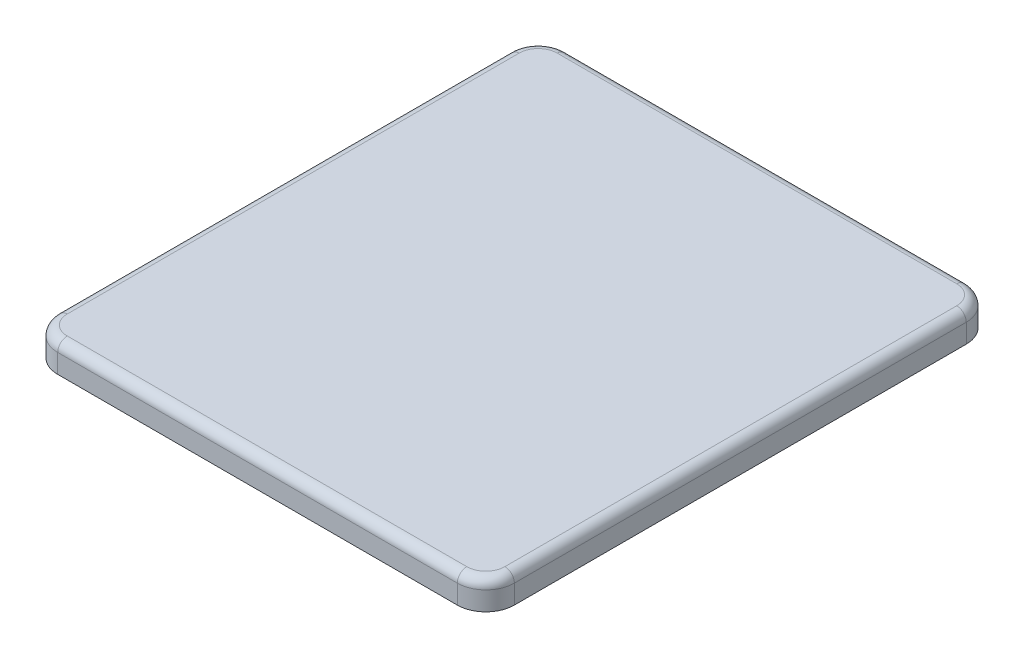
ISO-10303-21;
HEADER;
FILE_DESCRIPTION(('STEP AP214'),'2;1');
FILE_NAME('part.step','',(''),(''),'','','');
FILE_SCHEMA(('AUTOMOTIVE_DESIGN { 1 0 10303 214 1 1 1 1 }'));
ENDSEC;
DATA;
#1=APPLICATION_CONTEXT('core data for automotive mechanical design processes');
#2=APPLICATION_PROTOCOL_DEFINITION('international standard','automotive_design',2000,#1);
#3=PRODUCT_CONTEXT('',#1,'mechanical');
#4=PRODUCT('Part','Part','',(#3));
#5=PRODUCT_RELATED_PRODUCT_CATEGORY('part','',(#4));
#6=PRODUCT_DEFINITION_FORMATION('','',#4);
#7=PRODUCT_DEFINITION_CONTEXT('part definition',#1,'design');
#8=PRODUCT_DEFINITION('design','',#6,#7);
#9=PRODUCT_DEFINITION_SHAPE('','',#8);
#10=(LENGTH_UNIT() NAMED_UNIT(*) SI_UNIT(.MILLI.,.METRE.));
#11=(NAMED_UNIT(*) PLANE_ANGLE_UNIT() SI_UNIT($,.RADIAN.));
#12=(NAMED_UNIT(*) SI_UNIT($,.STERADIAN.) SOLID_ANGLE_UNIT());
#13=UNCERTAINTY_MEASURE_WITH_UNIT(LENGTH_MEASURE(1.E-05),#10,'distance_accuracy_value','');
#14=(GEOMETRIC_REPRESENTATION_CONTEXT(3) GLOBAL_UNCERTAINTY_ASSIGNED_CONTEXT((#13)) GLOBAL_UNIT_ASSIGNED_CONTEXT((#10,
#11,#12)) REPRESENTATION_CONTEXT('',''));
#15=CARTESIAN_POINT('',(0.,0.,0.));
#16=DIRECTION('',(0.,0.,1.));
#17=DIRECTION('',(1.,0.,0.));
#18=AXIS2_PLACEMENT_3D('',#15,#16,#17);
#19=CARTESIAN_POINT('',(24.,3.,26.75));
#20=DIRECTION('',(-1.,0.,0.));
#21=DIRECTION('',(0.,0.,1.));
#22=AXIS2_PLACEMENT_3D('',#19,#20,#21);
#23=PLANE('',#22);
#24=DIRECTION('',(0.,-1.,0.));
#25=VECTOR('',#24,1.);
#26=CARTESIAN_POINT('',(24.,3.,-23.75));
#27=LINE('',#26,#25);
#28=CARTESIAN_POINT('',(24.,0.,-23.75));
#29=VERTEX_POINT('',#28);
#30=CARTESIAN_POINT('',(24.,2.,-23.75));
#31=VERTEX_POINT('',#30);
#32=EDGE_CURVE('E171',#29,#31,#27,.F.);
#33=ORIENTED_EDGE('',*,*,#32,.T.);
#34=DIRECTION('',(0.,0.,-1.));
#35=VECTOR('',#34,1.);
#36=CARTESIAN_POINT('',(24.,2.,26.75));
#37=LINE('',#36,#35);
#38=CARTESIAN_POINT('',(24.,2.,23.75));
#39=VERTEX_POINT('',#38);
#40=EDGE_CURVE('E200',#31,#39,#37,.F.);
#41=ORIENTED_EDGE('',*,*,#40,.T.);
#42=DIRECTION('',(0.,-1.,0.));
#43=VECTOR('',#42,1.);
#44=CARTESIAN_POINT('',(24.,3.,23.75));
#45=LINE('',#44,#43);
#46=CARTESIAN_POINT('',(24.,0.,23.75));
#47=VERTEX_POINT('',#46);
#48=EDGE_CURVE('E169',#39,#47,#45,.T.);
#49=ORIENTED_EDGE('',*,*,#48,.T.);
#50=DIRECTION('',(0.,0.,-1.));
#51=VECTOR('',#50,1.);
#52=CARTESIAN_POINT('',(24.,0.,26.75));
#53=LINE('',#52,#51);
#54=EDGE_CURVE('E225',#47,#29,#53,.T.);
#55=ORIENTED_EDGE('',*,*,#54,.T.);
#56=EDGE_LOOP('',(#33,#41,#49,#55));
#57=FACE_BOUND('',#56,.T.);
#58=ADVANCED_FACE('F38',(#57),#23,.F.);
#59=CARTESIAN_POINT('',(-24.,3.,-26.75));
#60=DIRECTION('',(0.,0.,1.));
#61=DIRECTION('',(1.,0.,0.));
#62=AXIS2_PLACEMENT_3D('',#59,#60,#61);
#63=PLANE('',#62);
#64=DIRECTION('',(0.,-1.,0.));
#65=VECTOR('',#64,1.);
#66=CARTESIAN_POINT('',(-21.,3.,-26.75));
#67=LINE('',#66,#65);
#68=CARTESIAN_POINT('',(-21.,0.,-26.75));
#69=VERTEX_POINT('',#68);
#70=CARTESIAN_POINT('',(-21.,2.,-26.75));
#71=VERTEX_POINT('',#70);
#72=EDGE_CURVE('E166',#69,#71,#67,.F.);
#73=ORIENTED_EDGE('',*,*,#72,.T.);
#74=DIRECTION('',(-1.,0.,0.));
#75=VECTOR('',#74,1.);
#76=CARTESIAN_POINT('',(-24.,2.,-26.75));
#77=LINE('',#76,#75);
#78=CARTESIAN_POINT('',(21.,2.,-26.75));
#79=VERTEX_POINT('',#78);
#80=EDGE_CURVE('E196',#71,#79,#77,.F.);
#81=ORIENTED_EDGE('',*,*,#80,.T.);
#82=DIRECTION('',(0.,-1.,0.));
#83=VECTOR('',#82,1.);
#84=CARTESIAN_POINT('',(21.,3.,-26.75));
#85=LINE('',#84,#83);
#86=CARTESIAN_POINT('',(21.,0.,-26.75));
#87=VERTEX_POINT('',#86);
#88=EDGE_CURVE('E164',#79,#87,#85,.T.);
#89=ORIENTED_EDGE('',*,*,#88,.T.);
#90=DIRECTION('',(-1.,0.,0.));
#91=VECTOR('',#90,1.);
#92=CARTESIAN_POINT('',(-24.,0.,-26.75));
#93=LINE('',#92,#91);
#94=EDGE_CURVE('E154',#87,#69,#93,.T.);
#95=ORIENTED_EDGE('',*,*,#94,.T.);
#96=EDGE_LOOP('',(#73,#81,#89,#95));
#97=FACE_BOUND('',#96,.T.);
#98=ADVANCED_FACE('F238',(#97),#63,.F.);
#99=CARTESIAN_POINT('',(-24.,3.,26.75));
#100=DIRECTION('',(1.,0.,0.));
#101=DIRECTION('',(0.,0.,-1.));
#102=AXIS2_PLACEMENT_3D('',#99,#100,#101);
#103=PLANE('',#102);
#104=DIRECTION('',(0.,-1.,0.));
#105=VECTOR('',#104,1.);
#106=CARTESIAN_POINT('',(-24.,3.,23.75));
#107=LINE('',#106,#105);
#108=CARTESIAN_POINT('',(-24.,0.,23.75));
#109=VERTEX_POINT('',#108);
#110=CARTESIAN_POINT('',(-24.,2.,23.75));
#111=VERTEX_POINT('',#110);
#112=EDGE_CURVE('E141',#109,#111,#107,.F.);
#113=ORIENTED_EDGE('',*,*,#112,.T.);
#114=DIRECTION('',(0.,0.,1.));
#115=VECTOR('',#114,1.);
#116=CARTESIAN_POINT('',(-24.,2.,26.75));
#117=LINE('',#116,#115);
#118=CARTESIAN_POINT('',(-24.,2.,-23.75));
#119=VERTEX_POINT('',#118);
#120=EDGE_CURVE('E191',#111,#119,#117,.F.);
#121=ORIENTED_EDGE('',*,*,#120,.T.);
#122=DIRECTION('',(0.,-1.,0.));
#123=VECTOR('',#122,1.);
#124=CARTESIAN_POINT('',(-24.,3.,-23.75));
#125=LINE('',#124,#123);
#126=CARTESIAN_POINT('',(-24.,0.,-23.75));
#127=VERTEX_POINT('',#126);
#128=EDGE_CURVE('E145',#119,#127,#125,.T.);
#129=ORIENTED_EDGE('',*,*,#128,.T.);
#130=DIRECTION('',(0.,0.,1.));
#131=VECTOR('',#130,1.);
#132=CARTESIAN_POINT('',(-24.,0.,26.75));
#133=LINE('',#132,#131);
#134=EDGE_CURVE('E151',#127,#109,#133,.T.);
#135=ORIENTED_EDGE('',*,*,#134,.T.);
#136=EDGE_LOOP('',(#113,#121,#129,#135));
#137=FACE_BOUND('',#136,.T.);
#138=ADVANCED_FACE('F255',(#137),#103,.F.);
#139=CARTESIAN_POINT('',(-24.,3.,26.75));
#140=DIRECTION('',(0.,0.,-1.));
#141=DIRECTION('',(-1.,0.,0.));
#142=AXIS2_PLACEMENT_3D('',#139,#140,#141);
#143=PLANE('',#142);
#144=DIRECTION('',(0.,-1.,0.));
#145=VECTOR('',#144,1.);
#146=CARTESIAN_POINT('',(21.,3.,26.75));
#147=LINE('',#146,#145);
#148=CARTESIAN_POINT('',(21.,0.,26.75));
#149=VERTEX_POINT('',#148);
#150=CARTESIAN_POINT('',(21.,2.,26.75));
#151=VERTEX_POINT('',#150);
#152=EDGE_CURVE('E135',#149,#151,#147,.F.);
#153=ORIENTED_EDGE('',*,*,#152,.T.);
#154=DIRECTION('',(1.,0.,0.));
#155=VECTOR('',#154,1.);
#156=CARTESIAN_POINT('',(-24.,2.,26.75));
#157=LINE('',#156,#155);
#158=CARTESIAN_POINT('',(-21.,2.,26.75));
#159=VERTEX_POINT('',#158);
#160=EDGE_CURVE('E47',#151,#159,#157,.F.);
#161=ORIENTED_EDGE('',*,*,#160,.T.);
#162=DIRECTION('',(0.,-1.,0.));
#163=VECTOR('',#162,1.);
#164=CARTESIAN_POINT('',(-21.,3.,26.75));
#165=LINE('',#164,#163);
#166=CARTESIAN_POINT('',(-21.,0.,26.75));
#167=VERTEX_POINT('',#166);
#168=EDGE_CURVE('E127',#159,#167,#165,.T.);
#169=ORIENTED_EDGE('',*,*,#168,.T.);
#170=DIRECTION('',(1.,0.,0.));
#171=VECTOR('',#170,1.);
#172=CARTESIAN_POINT('',(-24.,0.,26.75));
#173=LINE('',#172,#171);
#174=EDGE_CURVE('E131',#167,#149,#173,.T.);
#175=ORIENTED_EDGE('',*,*,#174,.T.);
#176=EDGE_LOOP('',(#153,#161,#169,#175));
#177=FACE_BOUND('',#176,.T.);
#178=ADVANCED_FACE('F129',(#177),#143,.F.);
#179=CARTESIAN_POINT('',(0.,3.,0.));
#180=DIRECTION('',(0.,-1.,0.));
#181=DIRECTION('',(0.,0.,-1.));
#182=AXIS2_PLACEMENT_3D('',#179,#180,#181);
#183=PLANE('',#182);
#184=CARTESIAN_POINT('',(-21.,3.,-23.75));
#185=DIRECTION('',(0.,-1.,0.));
#186=DIRECTION('',(0.,0.,-1.));
#187=AXIS2_PLACEMENT_3D('',#184,#185,#186);
#188=CIRCLE('',#187,2.);
#189=CARTESIAN_POINT('',(-21.,3.,-25.75));
#190=VERTEX_POINT('',#189);
#191=CARTESIAN_POINT('',(-23.,3.,-23.75));
#192=VERTEX_POINT('',#191);
#193=EDGE_CURVE('E186',#190,#192,#188,.F.);
#194=ORIENTED_EDGE('',*,*,#193,.T.);
#195=DIRECTION('',(0.,0.,1.));
#196=VECTOR('',#195,1.);
#197=CARTESIAN_POINT('',(-23.,3.,0.));
#198=LINE('',#197,#196);
#199=CARTESIAN_POINT('',(-23.,3.,23.75));
#200=VERTEX_POINT('',#199);
#201=EDGE_CURVE('E188',#192,#200,#198,.T.);
#202=ORIENTED_EDGE('',*,*,#201,.T.);
#203=CARTESIAN_POINT('',(-21.,3.,23.75));
#204=DIRECTION('',(0.,-1.,0.));
#205=DIRECTION('',(0.,0.,-1.));
#206=AXIS2_PLACEMENT_3D('',#203,#204,#205);
#207=CIRCLE('',#206,2.);
#208=CARTESIAN_POINT('',(-21.,3.,25.75));
#209=VERTEX_POINT('',#208);
#210=EDGE_CURVE('E174',#200,#209,#207,.F.);
#211=ORIENTED_EDGE('',*,*,#210,.T.);
#212=DIRECTION('',(1.,0.,0.));
#213=VECTOR('',#212,1.);
#214=CARTESIAN_POINT('',(0.,3.,25.75));
#215=LINE('',#214,#213);
#216=CARTESIAN_POINT('',(21.,3.,25.75));
#217=VERTEX_POINT('',#216);
#218=EDGE_CURVE('E176',#209,#217,#215,.T.);
#219=ORIENTED_EDGE('',*,*,#218,.T.);
#220=CARTESIAN_POINT('',(21.,3.,23.75));
#221=DIRECTION('',(0.,-1.,0.));
#222=DIRECTION('',(0.,0.,-1.));
#223=AXIS2_PLACEMENT_3D('',#220,#221,#222);
#224=CIRCLE('',#223,2.);
#225=CARTESIAN_POINT('',(23.,3.,23.75));
#226=VERTEX_POINT('',#225);
#227=EDGE_CURVE('E178',#217,#226,#224,.F.);
#228=ORIENTED_EDGE('',*,*,#227,.T.);
#229=DIRECTION('',(0.,0.,-1.));
#230=VECTOR('',#229,1.);
#231=CARTESIAN_POINT('',(23.,3.,0.));
#232=LINE('',#231,#230);
#233=CARTESIAN_POINT('',(23.,3.,-23.75));
#234=VERTEX_POINT('',#233);
#235=EDGE_CURVE('E180',#226,#234,#232,.T.);
#236=ORIENTED_EDGE('',*,*,#235,.T.);
#237=CARTESIAN_POINT('',(21.,3.,-23.75));
#238=DIRECTION('',(0.,-1.,0.));
#239=DIRECTION('',(0.,0.,-1.));
#240=AXIS2_PLACEMENT_3D('',#237,#238,#239);
#241=CIRCLE('',#240,2.);
#242=CARTESIAN_POINT('',(21.,3.,-25.75));
#243=VERTEX_POINT('',#242);
#244=EDGE_CURVE('E182',#234,#243,#241,.F.);
#245=ORIENTED_EDGE('',*,*,#244,.T.);
#246=DIRECTION('',(-1.,0.,0.));
#247=VECTOR('',#246,1.);
#248=CARTESIAN_POINT('',(0.,3.,-25.75));
#249=LINE('',#248,#247);
#250=EDGE_CURVE('E184',#243,#190,#249,.T.);
#251=ORIENTED_EDGE('',*,*,#250,.T.);
#252=EDGE_LOOP('',(#194,#202,#211,#219,#228,#236,#245,#251));
#253=FACE_BOUND('',#252,.T.);
#254=ADVANCED_FACE('F265',(#253),#183,.F.);
#255=CARTESIAN_POINT('',(0.,0.,0.));
#256=DIRECTION('',(0.,-1.,0.));
#257=DIRECTION('',(0.,0.,-1.));
#258=AXIS2_PLACEMENT_3D('',#255,#256,#257);
#259=PLANE('',#258);
#260=ORIENTED_EDGE('',*,*,#174,.F.);
#261=CARTESIAN_POINT('',(-21.,0.,23.75));
#262=DIRECTION('',(0.,-1.,0.));
#263=DIRECTION('',(0.,0.,-1.));
#264=AXIS2_PLACEMENT_3D('',#261,#262,#263);
#265=CIRCLE('',#264,3.);
#266=EDGE_CURVE('E138',#167,#109,#265,.T.);
#267=ORIENTED_EDGE('',*,*,#266,.T.);
#268=ORIENTED_EDGE('',*,*,#134,.F.);
#269=CARTESIAN_POINT('',(-21.,0.,-23.75));
#270=DIRECTION('',(0.,-1.,0.));
#271=DIRECTION('',(0.,0.,-1.));
#272=AXIS2_PLACEMENT_3D('',#269,#270,#271);
#273=CIRCLE('',#272,3.);
#274=EDGE_CURVE('E146',#127,#69,#273,.T.);
#275=ORIENTED_EDGE('',*,*,#274,.T.);
#276=ORIENTED_EDGE('',*,*,#94,.F.);
#277=CARTESIAN_POINT('',(21.,0.,-23.75));
#278=DIRECTION('',(0.,-1.,0.));
#279=DIRECTION('',(0.,0.,-1.));
#280=AXIS2_PLACEMENT_3D('',#277,#278,#279);
#281=CIRCLE('',#280,3.);
#282=EDGE_CURVE('E159',#87,#29,#281,.T.);
#283=ORIENTED_EDGE('',*,*,#282,.T.);
#284=ORIENTED_EDGE('',*,*,#54,.F.);
#285=CARTESIAN_POINT('',(21.,0.,23.75));
#286=DIRECTION('',(0.,-1.,0.));
#287=DIRECTION('',(0.,0.,-1.));
#288=AXIS2_PLACEMENT_3D('',#285,#286,#287);
#289=CIRCLE('',#288,3.);
#290=EDGE_CURVE('E134',#47,#149,#289,.T.);
#291=ORIENTED_EDGE('',*,*,#290,.T.);
#292=EDGE_LOOP('',(#260,#267,#268,#275,#276,#283,#284,#291));
#293=FACE_BOUND('',#292,.T.);
#294=ADVANCED_FACE('F148',(#293),#259,.T.);
#295=CARTESIAN_POINT('',(-21.,3.,23.75));
#296=DIRECTION('',(0.,-1.,0.));
#297=DIRECTION('',(0.,0.,-1.));
#298=AXIS2_PLACEMENT_3D('',#295,#296,#297);
#299=CYLINDRICAL_SURFACE('',#298,3.);
#300=ORIENTED_EDGE('',*,*,#168,.F.);
#301=CARTESIAN_POINT('',(-21.,2.,23.75));
#302=DIRECTION('',(0.,-1.,0.));
#303=DIRECTION('',(0.,0.,-1.));
#304=AXIS2_PLACEMENT_3D('',#301,#302,#303);
#305=CIRCLE('',#304,3.);
#306=EDGE_CURVE('E11',#159,#111,#305,.T.);
#307=ORIENTED_EDGE('',*,*,#306,.T.);
#308=ORIENTED_EDGE('',*,*,#112,.F.);
#309=ORIENTED_EDGE('',*,*,#266,.F.);
#310=EDGE_LOOP('',(#300,#307,#308,#309));
#311=FACE_BOUND('',#310,.T.);
#312=ADVANCED_FACE('F139',(#311),#299,.T.);
#313=CARTESIAN_POINT('',(-21.,3.,-23.75));
#314=DIRECTION('',(0.,-1.,0.));
#315=DIRECTION('',(0.,0.,-1.));
#316=AXIS2_PLACEMENT_3D('',#313,#314,#315);
#317=CYLINDRICAL_SURFACE('',#316,3.);
#318=ORIENTED_EDGE('',*,*,#128,.F.);
#319=CARTESIAN_POINT('',(-21.,2.,-23.75));
#320=DIRECTION('',(0.,-1.,0.));
#321=DIRECTION('',(0.,0.,-1.));
#322=AXIS2_PLACEMENT_3D('',#319,#320,#321);
#323=CIRCLE('',#322,3.);
#324=EDGE_CURVE('E194',#119,#71,#323,.T.);
#325=ORIENTED_EDGE('',*,*,#324,.T.);
#326=ORIENTED_EDGE('',*,*,#72,.F.);
#327=ORIENTED_EDGE('',*,*,#274,.F.);
#328=EDGE_LOOP('',(#318,#325,#326,#327));
#329=FACE_BOUND('',#328,.T.);
#330=ADVANCED_FACE('F245',(#329),#317,.T.);
#331=CARTESIAN_POINT('',(21.,3.,-23.75));
#332=DIRECTION('',(0.,-1.,0.));
#333=DIRECTION('',(0.,0.,-1.));
#334=AXIS2_PLACEMENT_3D('',#331,#332,#333);
#335=CYLINDRICAL_SURFACE('',#334,3.);
#336=ORIENTED_EDGE('',*,*,#88,.F.);
#337=CARTESIAN_POINT('',(21.,2.,-23.75));
#338=DIRECTION('',(0.,-1.,0.));
#339=DIRECTION('',(0.,0.,-1.));
#340=AXIS2_PLACEMENT_3D('',#337,#338,#339);
#341=CIRCLE('',#340,3.);
#342=EDGE_CURVE('E198',#79,#31,#341,.T.);
#343=ORIENTED_EDGE('',*,*,#342,.T.);
#344=ORIENTED_EDGE('',*,*,#32,.F.);
#345=ORIENTED_EDGE('',*,*,#282,.F.);
#346=EDGE_LOOP('',(#336,#343,#344,#345));
#347=FACE_BOUND('',#346,.T.);
#348=ADVANCED_FACE('F271',(#347),#335,.T.);
#349=CARTESIAN_POINT('',(21.,3.,23.75));
#350=DIRECTION('',(0.,-1.,0.));
#351=DIRECTION('',(0.,0.,-1.));
#352=AXIS2_PLACEMENT_3D('',#349,#350,#351);
#353=CYLINDRICAL_SURFACE('',#352,3.);
#354=ORIENTED_EDGE('',*,*,#48,.F.);
#355=CARTESIAN_POINT('',(21.,2.,23.75));
#356=DIRECTION('',(0.,-1.,0.));
#357=DIRECTION('',(0.,0.,-1.));
#358=AXIS2_PLACEMENT_3D('',#355,#356,#357);
#359=CIRCLE('',#358,3.);
#360=EDGE_CURVE('E62',#39,#151,#359,.T.);
#361=ORIENTED_EDGE('',*,*,#360,.T.);
#362=ORIENTED_EDGE('',*,*,#152,.F.);
#363=ORIENTED_EDGE('',*,*,#290,.F.);
#364=EDGE_LOOP('',(#354,#361,#362,#363));
#365=FACE_BOUND('',#364,.T.);
#366=ADVANCED_FACE('F280',(#365),#353,.T.);
#367=CARTESIAN_POINT('',(23.,2.,0.));
#368=DIRECTION('',(0.,0.,-1.));
#369=DIRECTION('',(-1.,0.,0.));
#370=AXIS2_PLACEMENT_3D('',#367,#368,#369);
#371=CYLINDRICAL_SURFACE('',#370,1.);
#372=CARTESIAN_POINT('',(23.,2.,23.75));
#373=DIRECTION('',(0.,0.,1.));
#374=DIRECTION('',(1.,0.,0.));
#375=AXIS2_PLACEMENT_3D('',#372,#373,#374);
#376=CIRCLE('',#375,1.);
#377=EDGE_CURVE('E219',#39,#226,#376,.T.);
#378=ORIENTED_EDGE('',*,*,#377,.F.);
#379=ORIENTED_EDGE('',*,*,#40,.F.);
#380=CARTESIAN_POINT('',(23.,2.,-23.75));
#381=DIRECTION('',(0.,0.,-1.));
#382=DIRECTION('',(-1.,0.,0.));
#383=AXIS2_PLACEMENT_3D('',#380,#381,#382);
#384=CIRCLE('',#383,1.);
#385=EDGE_CURVE('E42',#234,#31,#384,.T.);
#386=ORIENTED_EDGE('',*,*,#385,.F.);
#387=ORIENTED_EDGE('',*,*,#235,.F.);
#388=EDGE_LOOP('',(#378,#379,#386,#387));
#389=FACE_BOUND('',#388,.T.);
#390=ADVANCED_FACE('F40',(#389),#371,.T.);
#391=CARTESIAN_POINT('',(21.,2.,-23.75));
#392=DIRECTION('',(0.,-1.,0.));
#393=DIRECTION('',(0.,0.,-1.));
#394=AXIS2_PLACEMENT_3D('',#391,#392,#393);
#395=TOROIDAL_SURFACE('',#394,2.,1.);
#396=ORIENTED_EDGE('',*,*,#385,.T.);
#397=ORIENTED_EDGE('',*,*,#342,.F.);
#398=CARTESIAN_POINT('',(21.,2.,-25.75));
#399=DIRECTION('',(-1.,0.,0.));
#400=DIRECTION('',(0.,0.,1.));
#401=AXIS2_PLACEMENT_3D('',#398,#399,#400);
#402=CIRCLE('',#401,1.);
#403=EDGE_CURVE('E217',#243,#79,#402,.T.);
#404=ORIENTED_EDGE('',*,*,#403,.F.);
#405=ORIENTED_EDGE('',*,*,#244,.F.);
#406=EDGE_LOOP('',(#396,#397,#404,#405));
#407=FACE_BOUND('',#406,.T.);
#408=ADVANCED_FACE('F272',(#407),#395,.T.);
#409=CARTESIAN_POINT('',(21.,2.,23.75));
#410=DIRECTION('',(0.,-1.,0.));
#411=DIRECTION('',(0.,0.,-1.));
#412=AXIS2_PLACEMENT_3D('',#409,#410,#411);
#413=TOROIDAL_SURFACE('',#412,2.,1.);
#414=ORIENTED_EDGE('',*,*,#377,.T.);
#415=ORIENTED_EDGE('',*,*,#227,.F.);
#416=CARTESIAN_POINT('',(21.,2.,25.75));
#417=DIRECTION('',(-1.,0.,0.));
#418=DIRECTION('',(0.,0.,1.));
#419=AXIS2_PLACEMENT_3D('',#416,#417,#418);
#420=CIRCLE('',#419,1.);
#421=EDGE_CURVE('E214',#151,#217,#420,.T.);
#422=ORIENTED_EDGE('',*,*,#421,.F.);
#423=ORIENTED_EDGE('',*,*,#360,.F.);
#424=EDGE_LOOP('',(#414,#415,#422,#423));
#425=FACE_BOUND('',#424,.T.);
#426=ADVANCED_FACE('F274',(#425),#413,.T.);
#427=CARTESIAN_POINT('',(0.,2.,-25.75));
#428=DIRECTION('',(-1.,0.,0.));
#429=DIRECTION('',(0.,0.,1.));
#430=AXIS2_PLACEMENT_3D('',#427,#428,#429);
#431=CYLINDRICAL_SURFACE('',#430,1.);
#432=ORIENTED_EDGE('',*,*,#403,.T.);
#433=ORIENTED_EDGE('',*,*,#80,.F.);
#434=CARTESIAN_POINT('',(-21.,2.,-25.75));
#435=DIRECTION('',(-1.,0.,0.));
#436=DIRECTION('',(0.,0.,1.));
#437=AXIS2_PLACEMENT_3D('',#434,#435,#436);
#438=CIRCLE('',#437,1.);
#439=EDGE_CURVE('E211',#190,#71,#438,.T.);
#440=ORIENTED_EDGE('',*,*,#439,.F.);
#441=ORIENTED_EDGE('',*,*,#250,.F.);
#442=EDGE_LOOP('',(#432,#433,#440,#441));
#443=FACE_BOUND('',#442,.T.);
#444=ADVANCED_FACE('F269',(#443),#431,.T.);
#445=CARTESIAN_POINT('',(0.,2.,25.75));
#446=DIRECTION('',(1.,0.,0.));
#447=DIRECTION('',(0.,0.,-1.));
#448=AXIS2_PLACEMENT_3D('',#445,#446,#447);
#449=CYLINDRICAL_SURFACE('',#448,1.);
#450=ORIENTED_EDGE('',*,*,#421,.T.);
#451=ORIENTED_EDGE('',*,*,#218,.F.);
#452=CARTESIAN_POINT('',(-21.,2.,25.75));
#453=DIRECTION('',(-1.,0.,0.));
#454=DIRECTION('',(0.,0.,1.));
#455=AXIS2_PLACEMENT_3D('',#452,#453,#454);
#456=CIRCLE('',#455,1.);
#457=EDGE_CURVE('E208',#159,#209,#456,.T.);
#458=ORIENTED_EDGE('',*,*,#457,.F.);
#459=ORIENTED_EDGE('',*,*,#160,.F.);
#460=EDGE_LOOP('',(#450,#451,#458,#459));
#461=FACE_BOUND('',#460,.T.);
#462=ADVANCED_FACE('F304',(#461),#449,.T.);
#463=CARTESIAN_POINT('',(-21.,2.,-23.75));
#464=DIRECTION('',(0.,-1.,0.));
#465=DIRECTION('',(0.,0.,-1.));
#466=AXIS2_PLACEMENT_3D('',#463,#464,#465);
#467=TOROIDAL_SURFACE('',#466,2.,1.);
#468=ORIENTED_EDGE('',*,*,#439,.T.);
#469=ORIENTED_EDGE('',*,*,#324,.F.);
#470=CARTESIAN_POINT('',(-23.,2.,-23.75));
#471=DIRECTION('',(0.,0.,1.));
#472=DIRECTION('',(1.,0.,0.));
#473=AXIS2_PLACEMENT_3D('',#470,#471,#472);
#474=CIRCLE('',#473,1.);
#475=EDGE_CURVE('E206',#192,#119,#474,.T.);
#476=ORIENTED_EDGE('',*,*,#475,.F.);
#477=ORIENTED_EDGE('',*,*,#193,.F.);
#478=EDGE_LOOP('',(#468,#469,#476,#477));
#479=FACE_BOUND('',#478,.T.);
#480=ADVANCED_FACE('F249',(#479),#467,.T.);
#481=CARTESIAN_POINT('',(-21.,2.,23.75));
#482=DIRECTION('',(0.,-1.,0.));
#483=DIRECTION('',(0.,0.,-1.));
#484=AXIS2_PLACEMENT_3D('',#481,#482,#483);
#485=TOROIDAL_SURFACE('',#484,2.,1.);
#486=ORIENTED_EDGE('',*,*,#457,.T.);
#487=ORIENTED_EDGE('',*,*,#210,.F.);
#488=CARTESIAN_POINT('',(-23.,2.,23.75));
#489=DIRECTION('',(0.,0.,-1.));
#490=DIRECTION('',(-1.,0.,0.));
#491=AXIS2_PLACEMENT_3D('',#488,#489,#490);
#492=CIRCLE('',#491,1.);
#493=EDGE_CURVE('E204',#111,#200,#492,.T.);
#494=ORIENTED_EDGE('',*,*,#493,.F.);
#495=ORIENTED_EDGE('',*,*,#306,.F.);
#496=EDGE_LOOP('',(#486,#487,#494,#495));
#497=FACE_BOUND('',#496,.T.);
#498=ADVANCED_FACE('F262',(#497),#485,.T.);
#499=CARTESIAN_POINT('',(-23.,2.,0.));
#500=DIRECTION('',(0.,0.,1.));
#501=DIRECTION('',(1.,0.,0.));
#502=AXIS2_PLACEMENT_3D('',#499,#500,#501);
#503=CYLINDRICAL_SURFACE('',#502,1.);
#504=ORIENTED_EDGE('',*,*,#475,.T.);
#505=ORIENTED_EDGE('',*,*,#120,.F.);
#506=ORIENTED_EDGE('',*,*,#493,.T.);
#507=ORIENTED_EDGE('',*,*,#201,.F.);
#508=EDGE_LOOP('',(#504,#505,#506,#507));
#509=FACE_BOUND('',#508,.T.);
#510=ADVANCED_FACE('F258',(#509),#503,.T.);
#511=CLOSED_SHELL('',(#58,#98,#138,#178,#254,#294,#312,#330,#348,#366,#390,#408,#426,#444,#462,
#480,#498,#510));
#512=MANIFOLD_SOLID_BREP('B2',#511);
#513=ADVANCED_BREP_SHAPE_REPRESENTATION('',(#18,#512),#14);
#514=SHAPE_DEFINITION_REPRESENTATION(#9,#513);
ENDSEC;
END-ISO-10303-21;
